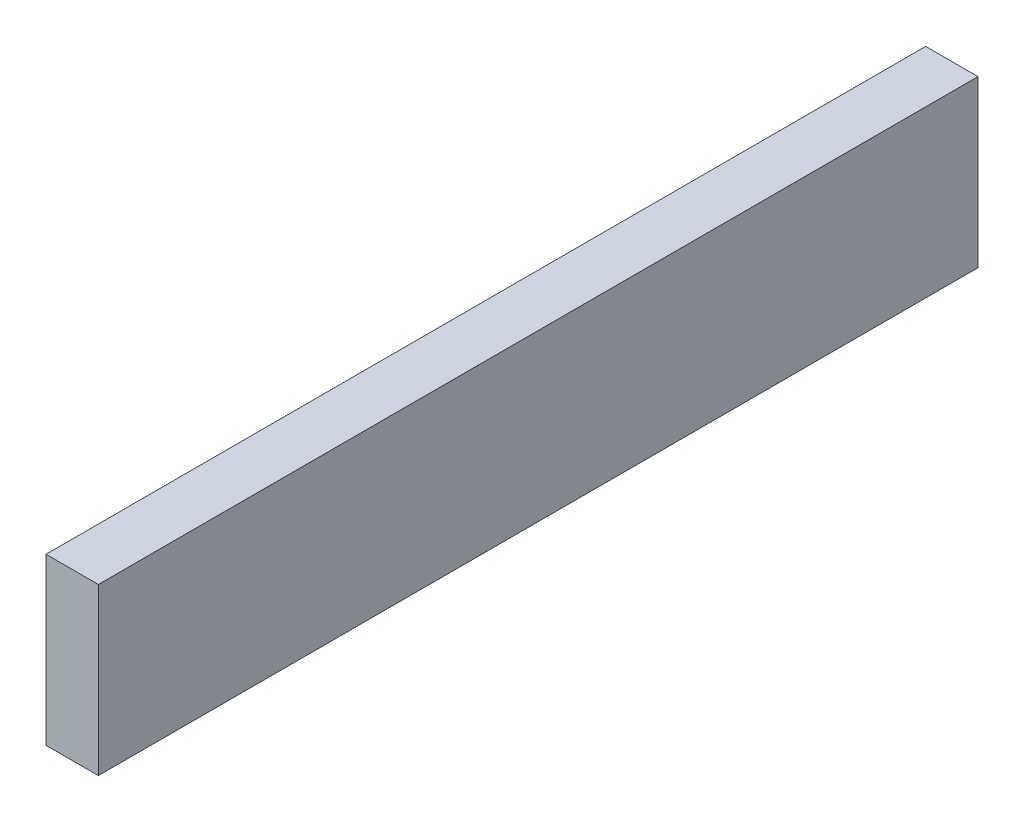
ISO-10303-21;
HEADER;
FILE_DESCRIPTION(('STEP AP214'),'2;1');
FILE_NAME('part.step','',(''),(''),'','','');
FILE_SCHEMA(('AUTOMOTIVE_DESIGN { 1 0 10303 214 1 1 1 1 }'));
ENDSEC;
DATA;
#1=APPLICATION_CONTEXT('core data for automotive mechanical design processes');
#2=APPLICATION_PROTOCOL_DEFINITION('international standard','automotive_design',2000,#1);
#3=PRODUCT_CONTEXT('',#1,'mechanical');
#4=PRODUCT('Part','Part','',(#3));
#5=PRODUCT_RELATED_PRODUCT_CATEGORY('part','',(#4));
#6=PRODUCT_DEFINITION_FORMATION('','',#4);
#7=PRODUCT_DEFINITION_CONTEXT('part definition',#1,'design');
#8=PRODUCT_DEFINITION('design','',#6,#7);
#9=PRODUCT_DEFINITION_SHAPE('','',#8);
#10=(LENGTH_UNIT() NAMED_UNIT(*) SI_UNIT(.MILLI.,.METRE.));
#11=(NAMED_UNIT(*) PLANE_ANGLE_UNIT() SI_UNIT($,.RADIAN.));
#12=(NAMED_UNIT(*) SI_UNIT($,.STERADIAN.) SOLID_ANGLE_UNIT());
#13=UNCERTAINTY_MEASURE_WITH_UNIT(LENGTH_MEASURE(1.E-05),#10,'distance_accuracy_value','');
#14=(GEOMETRIC_REPRESENTATION_CONTEXT(3) GLOBAL_UNCERTAINTY_ASSIGNED_CONTEXT((#13)) GLOBAL_UNIT_ASSIGNED_CONTEXT((#10,
#11,#12)) REPRESENTATION_CONTEXT('',''));
#15=CARTESIAN_POINT('',(0.,0.,0.));
#16=DIRECTION('',(0.,0.,1.));
#17=DIRECTION('',(1.,0.,0.));
#18=AXIS2_PLACEMENT_3D('',#15,#16,#17);
#19=CARTESIAN_POINT('',(3.,4.74224723359853,-9.85768286188459));
#20=DIRECTION('',(0.,0.,1.));
#21=DIRECTION('',(1.,0.,0.));
#22=AXIS2_PLACEMENT_3D('',#19,#20,#21);
#23=PLANE('',#22);
#24=DIRECTION('',(0.,1.,0.));
#25=VECTOR('',#24,1.);
#26=CARTESIAN_POINT('',(0.,4.74224723359853,-9.85768286188459));
#27=LINE('',#26,#25);
#28=CARTESIAN_POINT('',(0.,-4.74224723359854,-9.85768286188459));
#29=VERTEX_POINT('',#28);
#30=CARTESIAN_POINT('',(0.,4.74224723359853,-9.85768286188459));
#31=VERTEX_POINT('',#30);
#32=EDGE_CURVE('E96',#29,#31,#27,.T.);
#33=ORIENTED_EDGE('',*,*,#32,.T.);
#34=DIRECTION('',(-1.,0.,0.));
#35=VECTOR('',#34,1.);
#36=CARTESIAN_POINT('',(3.,4.74224723359853,-9.85768286188459));
#37=LINE('',#36,#35);
#38=CARTESIAN_POINT('',(3.,4.74224723359853,-9.85768286188459));
#39=VERTEX_POINT('',#38);
#40=EDGE_CURVE('E11',#39,#31,#37,.T.);
#41=ORIENTED_EDGE('',*,*,#40,.F.);
#42=DIRECTION('',(0.,1.,0.));
#43=VECTOR('',#42,1.);
#44=CARTESIAN_POINT('',(3.,4.74224723359853,-9.85768286188459));
#45=LINE('',#44,#43);
#46=CARTESIAN_POINT('',(3.,-4.74224723359854,-9.85768286188459));
#47=VERTEX_POINT('',#46);
#48=EDGE_CURVE('E84',#47,#39,#45,.T.);
#49=ORIENTED_EDGE('',*,*,#48,.F.);
#50=DIRECTION('',(-1.,0.,0.));
#51=VECTOR('',#50,1.);
#52=CARTESIAN_POINT('',(3.,-4.74224723359854,-9.85768286188459));
#53=LINE('',#52,#51);
#54=EDGE_CURVE('E92',#47,#29,#53,.T.);
#55=ORIENTED_EDGE('',*,*,#54,.T.);
#56=EDGE_LOOP('',(#33,#41,#49,#55));
#57=FACE_BOUND('',#56,.T.);
#58=ADVANCED_FACE('F33',(#57),#23,.F.);
#59=CARTESIAN_POINT('',(3.,4.74224723359853,40.5481393135574));
#60=DIRECTION('',(0.,-1.,0.));
#61=DIRECTION('',(0.,0.,-1.));
#62=AXIS2_PLACEMENT_3D('',#59,#60,#61);
#63=PLANE('',#62);
#64=DIRECTION('',(0.,0.,1.));
#65=VECTOR('',#64,1.);
#66=CARTESIAN_POINT('',(0.,4.74224723359853,40.5481393135574));
#67=LINE('',#66,#65);
#68=CARTESIAN_POINT('',(0.,4.74224723359853,40.5481393135574));
#69=VERTEX_POINT('',#68);
#70=EDGE_CURVE('E88',#31,#69,#67,.T.);
#71=ORIENTED_EDGE('',*,*,#70,.T.);
#72=DIRECTION('',(-1.,0.,0.));
#73=VECTOR('',#72,1.);
#74=CARTESIAN_POINT('',(3.,4.74224723359853,40.5481393135574));
#75=LINE('',#74,#73);
#76=CARTESIAN_POINT('',(3.,4.74224723359853,40.5481393135574));
#77=VERTEX_POINT('',#76);
#78=EDGE_CURVE('E41',#77,#69,#75,.T.);
#79=ORIENTED_EDGE('',*,*,#78,.F.);
#80=DIRECTION('',(0.,0.,1.));
#81=VECTOR('',#80,1.);
#82=CARTESIAN_POINT('',(3.,4.74224723359853,40.5481393135574));
#83=LINE('',#82,#81);
#84=EDGE_CURVE('E79',#39,#77,#83,.T.);
#85=ORIENTED_EDGE('',*,*,#84,.F.);
#86=ORIENTED_EDGE('',*,*,#40,.T.);
#87=EDGE_LOOP('',(#71,#79,#85,#86));
#88=FACE_BOUND('',#87,.T.);
#89=ADVANCED_FACE('F87',(#88),#63,.F.);
#90=CARTESIAN_POINT('',(3.,4.74224723359853,40.5481393135574));
#91=DIRECTION('',(0.,0.,-1.));
#92=DIRECTION('',(-1.,0.,0.));
#93=AXIS2_PLACEMENT_3D('',#90,#91,#92);
#94=PLANE('',#93);
#95=DIRECTION('',(0.,-1.,0.));
#96=VECTOR('',#95,1.);
#97=CARTESIAN_POINT('',(0.,4.74224723359853,40.5481393135574));
#98=LINE('',#97,#96);
#99=CARTESIAN_POINT('',(0.,-4.74224723359854,40.5481393135574));
#100=VERTEX_POINT('',#99);
#101=EDGE_CURVE('E66',#69,#100,#98,.T.);
#102=ORIENTED_EDGE('',*,*,#101,.T.);
#103=DIRECTION('',(-1.,0.,0.));
#104=VECTOR('',#103,1.);
#105=CARTESIAN_POINT('',(3.,-4.74224723359854,40.5481393135574));
#106=LINE('',#105,#104);
#107=CARTESIAN_POINT('',(3.,-4.74224723359854,40.5481393135574));
#108=VERTEX_POINT('',#107);
#109=EDGE_CURVE('E89',#108,#100,#106,.T.);
#110=ORIENTED_EDGE('',*,*,#109,.F.);
#111=DIRECTION('',(0.,-1.,0.));
#112=VECTOR('',#111,1.);
#113=CARTESIAN_POINT('',(3.,4.74224723359853,40.5481393135574));
#114=LINE('',#113,#112);
#115=EDGE_CURVE('E82',#77,#108,#114,.T.);
#116=ORIENTED_EDGE('',*,*,#115,.F.);
#117=ORIENTED_EDGE('',*,*,#78,.T.);
#118=EDGE_LOOP('',(#102,#110,#116,#117));
#119=FACE_BOUND('',#118,.T.);
#120=ADVANCED_FACE('F90',(#119),#94,.F.);
#121=CARTESIAN_POINT('',(3.,-4.74224723359854,40.5481393135574));
#122=DIRECTION('',(0.,1.,0.));
#123=DIRECTION('',(0.,0.,1.));
#124=AXIS2_PLACEMENT_3D('',#121,#122,#123);
#125=PLANE('',#124);
#126=DIRECTION('',(0.,0.,-1.));
#127=VECTOR('',#126,1.);
#128=CARTESIAN_POINT('',(0.,-4.74224723359854,40.5481393135574));
#129=LINE('',#128,#127);
#130=EDGE_CURVE('E72',#100,#29,#129,.T.);
#131=ORIENTED_EDGE('',*,*,#130,.T.);
#132=ORIENTED_EDGE('',*,*,#54,.F.);
#133=DIRECTION('',(0.,0.,-1.));
#134=VECTOR('',#133,1.);
#135=CARTESIAN_POINT('',(3.,-4.74224723359854,40.5481393135574));
#136=LINE('',#135,#134);
#137=EDGE_CURVE('E49',#108,#47,#136,.T.);
#138=ORIENTED_EDGE('',*,*,#137,.F.);
#139=ORIENTED_EDGE('',*,*,#109,.T.);
#140=EDGE_LOOP('',(#131,#132,#138,#139));
#141=FACE_BOUND('',#140,.T.);
#142=ADVANCED_FACE('F103',(#141),#125,.F.);
#143=CARTESIAN_POINT('',(3.,0.,0.));
#144=DIRECTION('',(1.,0.,0.));
#145=DIRECTION('',(0.,0.,-1.));
#146=AXIS2_PLACEMENT_3D('',#143,#144,#145);
#147=PLANE('',#146);
#148=ORIENTED_EDGE('',*,*,#48,.T.);
#149=ORIENTED_EDGE('',*,*,#84,.T.);
#150=ORIENTED_EDGE('',*,*,#115,.T.);
#151=ORIENTED_EDGE('',*,*,#137,.T.);
#152=EDGE_LOOP('',(#148,#149,#150,#151));
#153=FACE_BOUND('',#152,.T.);
#154=ADVANCED_FACE('F80',(#153),#147,.T.);
#155=CARTESIAN_POINT('',(0.,0.,0.));
#156=DIRECTION('',(1.,0.,0.));
#157=DIRECTION('',(0.,0.,-1.));
#158=AXIS2_PLACEMENT_3D('',#155,#156,#157);
#159=PLANE('',#158);
#160=ORIENTED_EDGE('',*,*,#32,.F.);
#161=ORIENTED_EDGE('',*,*,#130,.F.);
#162=ORIENTED_EDGE('',*,*,#101,.F.);
#163=ORIENTED_EDGE('',*,*,#70,.F.);
#164=EDGE_LOOP('',(#160,#161,#162,#163));
#165=FACE_BOUND('',#164,.T.);
#166=ADVANCED_FACE('F106',(#165),#159,.F.);
#167=CLOSED_SHELL('',(#58,#89,#120,#142,#154,#166));
#168=MANIFOLD_SOLID_BREP('B2',#167);
#169=ADVANCED_BREP_SHAPE_REPRESENTATION('',(#18,#168),#14);
#170=SHAPE_DEFINITION_REPRESENTATION(#9,#169);
ENDSEC;
END-ISO-10303-21;
